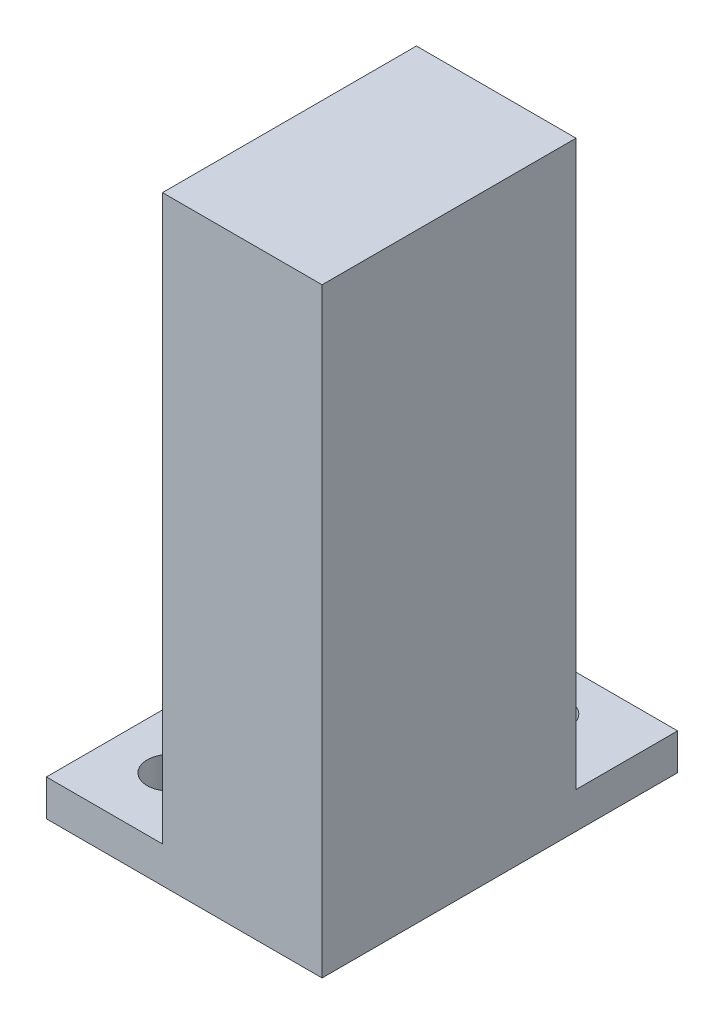
ISO-10303-21;
HEADER;
FILE_DESCRIPTION(('STEP AP214'),'2;1');
FILE_NAME('part.step','',(''),(''),'','','');
FILE_SCHEMA(('AUTOMOTIVE_DESIGN { 1 0 10303 214 1 1 1 1 }'));
ENDSEC;
DATA;
#1=APPLICATION_CONTEXT('core data for automotive mechanical design processes');
#2=APPLICATION_PROTOCOL_DEFINITION('international standard','automotive_design',2000,#1);
#3=PRODUCT_CONTEXT('',#1,'mechanical');
#4=PRODUCT('Part','Part','',(#3));
#5=PRODUCT_RELATED_PRODUCT_CATEGORY('part','',(#4));
#6=PRODUCT_DEFINITION_FORMATION('','',#4);
#7=PRODUCT_DEFINITION_CONTEXT('part definition',#1,'design');
#8=PRODUCT_DEFINITION('design','',#6,#7);
#9=PRODUCT_DEFINITION_SHAPE('','',#8);
#10=(LENGTH_UNIT() NAMED_UNIT(*) SI_UNIT(.MILLI.,.METRE.));
#11=(NAMED_UNIT(*) PLANE_ANGLE_UNIT() SI_UNIT($,.RADIAN.));
#12=(NAMED_UNIT(*) SI_UNIT($,.STERADIAN.) SOLID_ANGLE_UNIT());
#13=UNCERTAINTY_MEASURE_WITH_UNIT(LENGTH_MEASURE(1.E-05),#10,'distance_accuracy_value','');
#14=(GEOMETRIC_REPRESENTATION_CONTEXT(3) GLOBAL_UNCERTAINTY_ASSIGNED_CONTEXT((#13)) GLOBAL_UNIT_ASSIGNED_CONTEXT((#10,
#11,#12)) REPRESENTATION_CONTEXT('',''));
#15=CARTESIAN_POINT('',(0.,0.,0.));
#16=DIRECTION('',(0.,0.,1.));
#17=DIRECTION('',(1.,0.,0.));
#18=AXIS2_PLACEMENT_3D('',#15,#16,#17);
#19=CARTESIAN_POINT('',(0.,0.,0.));
#20=DIRECTION('',(0.,0.,1.));
#21=DIRECTION('',(1.,0.,0.));
#22=AXIS2_PLACEMENT_3D('',#19,#20,#21);
#23=PLANE('',#22);
#24=CARTESIAN_POINT('',(0.,35.7196543089587,0.));
#25=DIRECTION('',(0.,0.,1.));
#26=DIRECTION('',(1.,0.,0.));
#27=AXIS2_PLACEMENT_3D('',#24,#25,#26);
#28=CIRCLE('',#27,3.1);
#29=CARTESIAN_POINT('',(3.09999999999999,35.7196543089587,0.));
#30=VERTEX_POINT('',#29);
#31=EDGE_CURVE('E226',#30,#30,#28,.T.);
#32=ORIENTED_EDGE('',*,*,#31,.T.);
#33=EDGE_LOOP('',(#32));
#34=FACE_BOUND('',#33,.T.);
#35=CARTESIAN_POINT('',(0.,7.7196543089587,0.));
#36=DIRECTION('',(0.,0.,1.));
#37=DIRECTION('',(1.,0.,0.));
#38=AXIS2_PLACEMENT_3D('',#35,#36,#37);
#39=CIRCLE('',#38,3.1);
#40=CARTESIAN_POINT('',(3.1,7.7196543089587,0.));
#41=VERTEX_POINT('',#40);
#42=EDGE_CURVE('E222',#41,#41,#39,.T.);
#43=ORIENTED_EDGE('',*,*,#42,.T.);
#44=EDGE_LOOP('',(#43));
#45=FACE_BOUND('',#44,.T.);
#46=DIRECTION('',(1.,0.,0.));
#47=VECTOR('',#46,1.);
#48=CARTESIAN_POINT('',(0.,-28.5303456910413,0.));
#49=LINE('',#48,#47);
#50=CARTESIAN_POINT('',(-11.,-28.5303456910413,0.));
#51=VERTEX_POINT('',#50);
#52=CARTESIAN_POINT('',(11.,-28.5303456910413,0.));
#53=VERTEX_POINT('',#52);
#54=EDGE_CURVE('E132',#51,#53,#49,.T.);
#55=ORIENTED_EDGE('',*,*,#54,.F.);
#56=DIRECTION('',(0.,-1.,0.));
#57=VECTOR('',#56,1.);
#58=CARTESIAN_POINT('',(-11.,49.2196543089587,0.));
#59=LINE('',#58,#57);
#60=CARTESIAN_POINT('',(-11.,49.2196543089587,0.));
#61=VERTEX_POINT('',#60);
#62=EDGE_CURVE('E237',#61,#51,#59,.T.);
#63=ORIENTED_EDGE('',*,*,#62,.F.);
#64=DIRECTION('',(-1.,0.,0.));
#65=VECTOR('',#64,1.);
#66=CARTESIAN_POINT('',(11.,49.2196543089587,0.));
#67=LINE('',#66,#65);
#68=CARTESIAN_POINT('',(11.,49.2196543089587,0.));
#69=VERTEX_POINT('',#68);
#70=EDGE_CURVE('E233',#69,#61,#67,.T.);
#71=ORIENTED_EDGE('',*,*,#70,.F.);
#72=DIRECTION('',(0.,1.,0.));
#73=VECTOR('',#72,1.);
#74=CARTESIAN_POINT('',(11.,49.2196543089587,0.));
#75=LINE('',#74,#73);
#76=EDGE_CURVE('E242',#53,#69,#75,.T.);
#77=ORIENTED_EDGE('',*,*,#76,.F.);
#78=EDGE_LOOP('',(#55,#63,#71,#77));
#79=FACE_BOUND('',#78,.T.);
#80=ADVANCED_FACE('F45',(#34,#45,#79),#23,.F.);
#81=CARTESIAN_POINT('',(-11.,49.2196543089587,30.));
#82=DIRECTION('',(1.,0.,0.));
#83=DIRECTION('',(0.,0.,-1.));
#84=AXIS2_PLACEMENT_3D('',#81,#82,#83);
#85=PLANE('',#84);
#86=DIRECTION('',(0.,0.,-1.));
#87=VECTOR('',#86,1.);
#88=CARTESIAN_POINT('',(-11.,-28.5303456910413,0.));
#89=LINE('',#88,#87);
#90=CARTESIAN_POINT('',(-11.,-28.5303456910413,35.));
#91=VERTEX_POINT('',#90);
#92=EDGE_CURVE('E69',#91,#51,#89,.T.);
#93=ORIENTED_EDGE('',*,*,#92,.F.);
#94=DIRECTION('',(0.,-1.,0.));
#95=VECTOR('',#94,1.);
#96=CARTESIAN_POINT('',(-11.,49.2196543089587,35.));
#97=LINE('',#96,#95);
#98=CARTESIAN_POINT('',(-11.,49.2196543089587,35.));
#99=VERTEX_POINT('',#98);
#100=EDGE_CURVE('E199',#99,#91,#97,.T.);
#101=ORIENTED_EDGE('',*,*,#100,.F.);
#102=DIRECTION('',(0.,0.,-1.));
#103=VECTOR('',#102,1.);
#104=CARTESIAN_POINT('',(-11.,49.2196543089587,30.));
#105=LINE('',#104,#103);
#106=EDGE_CURVE('E11',#99,#61,#105,.T.);
#107=ORIENTED_EDGE('',*,*,#106,.T.);
#108=ORIENTED_EDGE('',*,*,#62,.T.);
#109=EDGE_LOOP('',(#93,#101,#107,#108));
#110=FACE_BOUND('',#109,.T.);
#111=ADVANCED_FACE('F274',(#110),#85,.F.);
#112=DIRECTION('',(-1.,0.,0.));
#113=VECTOR('',#112,1.);
#114=CARTESIAN_POINT('',(0.,-28.5303456910413,0.));
#115=LINE('',#114,#113);
#116=CARTESIAN_POINT('',(-27.,-28.5303456910413,0.));
#117=VERTEX_POINT('',#116);
#118=EDGE_CURVE('E183',#51,#117,#115,.T.);
#119=ORIENTED_EDGE('',*,*,#118,.F.);
#120=DIRECTION('',(0.,-1.,0.));
#121=VECTOR('',#120,1.);
#122=CARTESIAN_POINT('',(-11.,-28.5303456910413,0.));
#123=LINE('',#122,#121);
#124=CARTESIAN_POINT('',(-11.,-33.5303456910413,0.));
#125=VERTEX_POINT('',#124);
#126=EDGE_CURVE('E123',#51,#125,#123,.T.);
#127=ORIENTED_EDGE('',*,*,#126,.T.);
#128=DIRECTION('',(1.,0.,0.));
#129=VECTOR('',#128,1.);
#130=CARTESIAN_POINT('',(-11.,-33.5303456910413,0.));
#131=LINE('',#130,#129);
#132=CARTESIAN_POINT('',(-27.,-33.5303456910413,0.));
#133=VERTEX_POINT('',#132);
#134=EDGE_CURVE('E138',#133,#125,#131,.T.);
#135=ORIENTED_EDGE('',*,*,#134,.F.);
#136=DIRECTION('',(0.,-1.,0.));
#137=VECTOR('',#136,1.);
#138=CARTESIAN_POINT('',(-27.,-28.5303456910413,0.));
#139=LINE('',#138,#137);
#140=EDGE_CURVE('E195',#117,#133,#139,.T.);
#141=ORIENTED_EDGE('',*,*,#140,.F.);
#142=EDGE_LOOP('',(#119,#127,#135,#141));
#143=FACE_BOUND('',#142,.T.);
#144=ADVANCED_FACE('F264',(#143),#23,.F.);
#145=CARTESIAN_POINT('',(11.,49.2196543089587,30.));
#146=DIRECTION('',(0.,-1.,0.));
#147=DIRECTION('',(0.,0.,-1.));
#148=AXIS2_PLACEMENT_3D('',#145,#146,#147);
#149=PLANE('',#148);
#150=ORIENTED_EDGE('',*,*,#70,.T.);
#151=ORIENTED_EDGE('',*,*,#106,.F.);
#152=DIRECTION('',(-1.,0.,0.));
#153=VECTOR('',#152,1.);
#154=CARTESIAN_POINT('',(11.,49.2196543089587,35.));
#155=LINE('',#154,#153);
#156=CARTESIAN_POINT('',(11.,49.2196543089587,35.));
#157=VERTEX_POINT('',#156);
#158=EDGE_CURVE('E213',#157,#99,#155,.T.);
#159=ORIENTED_EDGE('',*,*,#158,.F.);
#160=DIRECTION('',(0.,0.,-1.));
#161=VECTOR('',#160,1.);
#162=CARTESIAN_POINT('',(11.,49.2196543089587,30.));
#163=LINE('',#162,#161);
#164=EDGE_CURVE('E245',#157,#69,#163,.T.);
#165=ORIENTED_EDGE('',*,*,#164,.T.);
#166=EDGE_LOOP('',(#150,#151,#159,#165));
#167=FACE_BOUND('',#166,.T.);
#168=ADVANCED_FACE('F47',(#167),#149,.F.);
#169=CARTESIAN_POINT('',(-11.,-33.5303456910413,30.));
#170=DIRECTION('',(0.,1.,0.));
#171=DIRECTION('',(0.,0.,1.));
#172=AXIS2_PLACEMENT_3D('',#169,#170,#171);
#173=PLANE('',#172);
#174=ORIENTED_EDGE('',*,*,#134,.T.);
#175=DIRECTION('',(0.,0.,-1.));
#176=VECTOR('',#175,1.);
#177=CARTESIAN_POINT('',(-11.,-33.5303456910413,0.));
#178=LINE('',#177,#176);
#179=CARTESIAN_POINT('',(-11.,-33.5303456910413,-14.));
#180=VERTEX_POINT('',#179);
#181=EDGE_CURVE('E61',#125,#180,#178,.T.);
#182=ORIENTED_EDGE('',*,*,#181,.T.);
#183=DIRECTION('',(1.,0.,0.));
#184=VECTOR('',#183,1.);
#185=CARTESIAN_POINT('',(0.,-33.5303456910413,-14.));
#186=LINE('',#185,#184);
#187=CARTESIAN_POINT('',(11.,-33.5303456910413,-14.));
#188=VERTEX_POINT('',#187);
#189=EDGE_CURVE('E127',#180,#188,#186,.T.);
#190=ORIENTED_EDGE('',*,*,#189,.T.);
#191=DIRECTION('',(0.,0.,-1.));
#192=VECTOR('',#191,1.);
#193=CARTESIAN_POINT('',(11.,-33.5303456910413,30.));
#194=LINE('',#193,#192);
#195=CARTESIAN_POINT('',(11.,-33.5303456910413,35.));
#196=VERTEX_POINT('',#195);
#197=EDGE_CURVE('E54',#196,#188,#194,.T.);
#198=ORIENTED_EDGE('',*,*,#197,.F.);
#199=DIRECTION('',(1.,0.,0.));
#200=VECTOR('',#199,1.);
#201=CARTESIAN_POINT('',(-11.,-33.5303456910413,35.));
#202=LINE('',#201,#200);
#203=CARTESIAN_POINT('',(-27.,-33.5303456910413,35.));
#204=VERTEX_POINT('',#203);
#205=EDGE_CURVE('E205',#204,#196,#202,.T.);
#206=ORIENTED_EDGE('',*,*,#205,.F.);
#207=DIRECTION('',(0.,0.,1.));
#208=VECTOR('',#207,1.);
#209=CARTESIAN_POINT('',(-27.,-33.5303456910413,0.));
#210=LINE('',#209,#208);
#211=EDGE_CURVE('E172',#133,#204,#210,.T.);
#212=ORIENTED_EDGE('',*,*,#211,.F.);
#213=EDGE_LOOP('',(#174,#182,#190,#198,#206,#212));
#214=FACE_BOUND('',#213,.T.);
#215=CARTESIAN_POINT('',(-19.,-33.5303456910413,26.));
#216=DIRECTION('',(0.,-1.,0.));
#217=DIRECTION('',(0.,0.,-1.));
#218=AXIS2_PLACEMENT_3D('',#215,#216,#217);
#219=CIRCLE('',#218,3.1);
#220=CARTESIAN_POINT('',(-19.,-33.5303456910413,22.9));
#221=VERTEX_POINT('',#220);
#222=EDGE_CURVE('E140',#221,#221,#219,.T.);
#223=ORIENTED_EDGE('',*,*,#222,.F.);
#224=EDGE_LOOP('',(#223));
#225=FACE_BOUND('',#224,.T.);
#226=CARTESIAN_POINT('',(-19.,-33.5303456910413,9.));
#227=DIRECTION('',(0.,-1.,0.));
#228=DIRECTION('',(0.,0.,-1.));
#229=AXIS2_PLACEMENT_3D('',#226,#227,#228);
#230=CIRCLE('',#229,3.1);
#231=CARTESIAN_POINT('',(-19.,-33.5303456910413,5.9));
#232=VERTEX_POINT('',#231);
#233=EDGE_CURVE('E144',#232,#232,#230,.T.);
#234=ORIENTED_EDGE('',*,*,#233,.F.);
#235=EDGE_LOOP('',(#234));
#236=FACE_BOUND('',#235,.T.);
#237=CARTESIAN_POINT('',(0.,-33.5303456910413,-7.));
#238=DIRECTION('',(0.,-1.,0.));
#239=DIRECTION('',(0.,0.,-1.));
#240=AXIS2_PLACEMENT_3D('',#237,#238,#239);
#241=CIRCLE('',#240,3.1);
#242=CARTESIAN_POINT('',(0.,-33.5303456910413,-10.1));
#243=VERTEX_POINT('',#242);
#244=EDGE_CURVE('E148',#243,#243,#241,.T.);
#245=ORIENTED_EDGE('',*,*,#244,.F.);
#246=EDGE_LOOP('',(#245));
#247=FACE_BOUND('',#246,.T.);
#248=ADVANCED_FACE('F135',(#214,#225,#236,#247),#173,.F.);
#249=CARTESIAN_POINT('',(11.,49.2196543089587,30.));
#250=DIRECTION('',(-1.,0.,0.));
#251=DIRECTION('',(0.,0.,1.));
#252=AXIS2_PLACEMENT_3D('',#249,#250,#251);
#253=PLANE('',#252);
#254=ORIENTED_EDGE('',*,*,#197,.T.);
#255=DIRECTION('',(0.,-1.,0.));
#256=VECTOR('',#255,1.);
#257=CARTESIAN_POINT('',(11.,-28.5303456910413,-14.));
#258=LINE('',#257,#256);
#259=CARTESIAN_POINT('',(11.,-28.5303456910413,-14.));
#260=VERTEX_POINT('',#259);
#261=EDGE_CURVE('E129',#260,#188,#258,.T.);
#262=ORIENTED_EDGE('',*,*,#261,.F.);
#263=DIRECTION('',(0.,0.,1.));
#264=VECTOR('',#263,1.);
#265=CARTESIAN_POINT('',(11.,-28.5303456910413,0.));
#266=LINE('',#265,#264);
#267=EDGE_CURVE('E152',#260,#53,#266,.T.);
#268=ORIENTED_EDGE('',*,*,#267,.T.);
#269=ORIENTED_EDGE('',*,*,#76,.T.);
#270=ORIENTED_EDGE('',*,*,#164,.F.);
#271=DIRECTION('',(0.,1.,0.));
#272=VECTOR('',#271,1.);
#273=CARTESIAN_POINT('',(11.,-33.5303456910413,35.));
#274=LINE('',#273,#272);
#275=EDGE_CURVE('E209',#196,#157,#274,.T.);
#276=ORIENTED_EDGE('',*,*,#275,.F.);
#277=EDGE_LOOP('',(#254,#262,#268,#269,#270,#276));
#278=FACE_BOUND('',#277,.T.);
#279=ADVANCED_FACE('F251',(#278),#253,.F.);
#280=CARTESIAN_POINT('',(0.,35.7196543089587,30.));
#281=DIRECTION('',(0.,0.,-1.));
#282=DIRECTION('',(-1.,0.,0.));
#283=AXIS2_PLACEMENT_3D('',#280,#281,#282);
#284=CYLINDRICAL_SURFACE('',#283,3.1);
#285=CARTESIAN_POINT('',(0.,35.7196543089587,30.));
#286=DIRECTION('',(0.,0.,1.));
#287=DIRECTION('',(1.,0.,0.));
#288=AXIS2_PLACEMENT_3D('',#285,#286,#287);
#289=CIRCLE('',#288,3.1);
#290=CARTESIAN_POINT('',(3.09999999999999,35.7196543089587,30.));
#291=VERTEX_POINT('',#290);
#292=EDGE_CURVE('E221',#291,#291,#289,.T.);
#293=ORIENTED_EDGE('',*,*,#292,.T.);
#294=EDGE_LOOP('',(#293));
#295=FACE_BOUND('',#294,.T.);
#296=ORIENTED_EDGE('',*,*,#31,.F.);
#297=EDGE_LOOP('',(#296));
#298=FACE_BOUND('',#297,.T.);
#299=ADVANCED_FACE('F310',(#295,#298),#284,.F.);
#300=CARTESIAN_POINT('',(0.,7.7196543089587,30.));
#301=DIRECTION('',(0.,0.,-1.));
#302=DIRECTION('',(-1.,0.,0.));
#303=AXIS2_PLACEMENT_3D('',#300,#301,#302);
#304=CYLINDRICAL_SURFACE('',#303,3.1);
#305=CARTESIAN_POINT('',(0.,7.7196543089587,30.));
#306=DIRECTION('',(0.,0.,1.));
#307=DIRECTION('',(1.,0.,0.));
#308=AXIS2_PLACEMENT_3D('',#305,#306,#307);
#309=CIRCLE('',#308,3.1);
#310=CARTESIAN_POINT('',(3.1,7.7196543089587,30.));
#311=VERTEX_POINT('',#310);
#312=EDGE_CURVE('E217',#311,#311,#309,.T.);
#313=ORIENTED_EDGE('',*,*,#312,.T.);
#314=EDGE_LOOP('',(#313));
#315=FACE_BOUND('',#314,.T.);
#316=ORIENTED_EDGE('',*,*,#42,.F.);
#317=EDGE_LOOP('',(#316));
#318=FACE_BOUND('',#317,.T.);
#319=ADVANCED_FACE('F314',(#315,#318),#304,.F.);
#320=CARTESIAN_POINT('',(0.,0.,30.));
#321=DIRECTION('',(0.,0.,1.));
#322=DIRECTION('',(1.,0.,0.));
#323=AXIS2_PLACEMENT_3D('',#320,#321,#322);
#324=PLANE('',#323);
#325=ORIENTED_EDGE('',*,*,#312,.F.);
#326=EDGE_LOOP('',(#325));
#327=FACE_BOUND('',#326,.T.);
#328=ADVANCED_FACE('F319',(#327),#324,.F.);
#329=ORIENTED_EDGE('',*,*,#292,.F.);
#330=EDGE_LOOP('',(#329));
#331=FACE_BOUND('',#330,.T.);
#332=ADVANCED_FACE('F324',(#331),#324,.F.);
#333=CARTESIAN_POINT('',(0.,0.,35.));
#334=DIRECTION('',(0.,0.,1.));
#335=DIRECTION('',(1.,0.,0.));
#336=AXIS2_PLACEMENT_3D('',#333,#334,#335);
#337=PLANE('',#336);
#338=ORIENTED_EDGE('',*,*,#100,.T.);
#339=DIRECTION('',(1.,0.,0.));
#340=VECTOR('',#339,1.);
#341=CARTESIAN_POINT('',(0.,-28.5303456910413,35.));
#342=LINE('',#341,#340);
#343=CARTESIAN_POINT('',(-27.,-28.5303456910413,35.));
#344=VERTEX_POINT('',#343);
#345=EDGE_CURVE('E176',#344,#91,#342,.T.);
#346=ORIENTED_EDGE('',*,*,#345,.F.);
#347=DIRECTION('',(0.,-1.,0.));
#348=VECTOR('',#347,1.);
#349=CARTESIAN_POINT('',(-27.,-28.5303456910413,35.));
#350=LINE('',#349,#348);
#351=EDGE_CURVE('E187',#344,#204,#350,.T.);
#352=ORIENTED_EDGE('',*,*,#351,.T.);
#353=ORIENTED_EDGE('',*,*,#205,.T.);
#354=ORIENTED_EDGE('',*,*,#275,.T.);
#355=ORIENTED_EDGE('',*,*,#158,.T.);
#356=EDGE_LOOP('',(#338,#346,#352,#353,#354,#355));
#357=FACE_BOUND('',#356,.T.);
#358=ADVANCED_FACE('F254',(#357),#337,.T.);
#359=CARTESIAN_POINT('',(-19.,-28.5303456910413,9.));
#360=DIRECTION('',(0.,-1.,0.));
#361=DIRECTION('',(0.,0.,-1.));
#362=AXIS2_PLACEMENT_3D('',#359,#360,#361);
#363=CYLINDRICAL_SURFACE('',#362,3.1);
#364=CARTESIAN_POINT('',(-19.,-28.5303456910413,9.));
#365=DIRECTION('',(0.,-1.,0.));
#366=DIRECTION('',(0.,0.,-1.));
#367=AXIS2_PLACEMENT_3D('',#364,#365,#366);
#368=CIRCLE('',#367,3.1);
#369=CARTESIAN_POINT('',(-19.,-28.5303456910413,5.9));
#370=VERTEX_POINT('',#369);
#371=EDGE_CURVE('E171',#370,#370,#368,.T.);
#372=ORIENTED_EDGE('',*,*,#371,.F.);
#373=EDGE_LOOP('',(#372));
#374=FACE_BOUND('',#373,.T.);
#375=ORIENTED_EDGE('',*,*,#233,.T.);
#376=EDGE_LOOP('',(#375));
#377=FACE_BOUND('',#376,.T.);
#378=ADVANCED_FACE('F330',(#374,#377),#363,.F.);
#379=CARTESIAN_POINT('',(-19.,-28.5303456910413,26.));
#380=DIRECTION('',(0.,-1.,0.));
#381=DIRECTION('',(0.,0.,-1.));
#382=AXIS2_PLACEMENT_3D('',#379,#380,#381);
#383=CYLINDRICAL_SURFACE('',#382,3.1);
#384=CARTESIAN_POINT('',(-19.,-28.5303456910413,26.));
#385=DIRECTION('',(0.,-1.,0.));
#386=DIRECTION('',(0.,0.,-1.));
#387=AXIS2_PLACEMENT_3D('',#384,#385,#386);
#388=CIRCLE('',#387,3.1);
#389=CARTESIAN_POINT('',(-19.,-28.5303456910413,22.9));
#390=VERTEX_POINT('',#389);
#391=EDGE_CURVE('E167',#390,#390,#388,.T.);
#392=ORIENTED_EDGE('',*,*,#391,.F.);
#393=EDGE_LOOP('',(#392));
#394=FACE_BOUND('',#393,.T.);
#395=ORIENTED_EDGE('',*,*,#222,.T.);
#396=EDGE_LOOP('',(#395));
#397=FACE_BOUND('',#396,.T.);
#398=ADVANCED_FACE('F285',(#394,#397),#383,.F.);
#399=CARTESIAN_POINT('',(-27.,-28.5303456910413,0.));
#400=DIRECTION('',(1.,0.,0.));
#401=DIRECTION('',(0.,0.,-1.));
#402=AXIS2_PLACEMENT_3D('',#399,#400,#401);
#403=PLANE('',#402);
#404=ORIENTED_EDGE('',*,*,#211,.T.);
#405=ORIENTED_EDGE('',*,*,#351,.F.);
#406=DIRECTION('',(0.,0.,1.));
#407=VECTOR('',#406,1.);
#408=CARTESIAN_POINT('',(-27.,-28.5303456910413,0.));
#409=LINE('',#408,#407);
#410=EDGE_CURVE('E180',#117,#344,#409,.T.);
#411=ORIENTED_EDGE('',*,*,#410,.F.);
#412=ORIENTED_EDGE('',*,*,#140,.T.);
#413=EDGE_LOOP('',(#404,#405,#411,#412));
#414=FACE_BOUND('',#413,.T.);
#415=ADVANCED_FACE('F260',(#414),#403,.F.);
#416=CARTESIAN_POINT('',(0.,-28.5303456910413,0.));
#417=DIRECTION('',(0.,-1.,0.));
#418=DIRECTION('',(0.,0.,-1.));
#419=AXIS2_PLACEMENT_3D('',#416,#417,#418);
#420=PLANE('',#419);
#421=ORIENTED_EDGE('',*,*,#391,.T.);
#422=EDGE_LOOP('',(#421));
#423=FACE_BOUND('',#422,.T.);
#424=ORIENTED_EDGE('',*,*,#371,.T.);
#425=EDGE_LOOP('',(#424));
#426=FACE_BOUND('',#425,.T.);
#427=ORIENTED_EDGE('',*,*,#345,.T.);
#428=ORIENTED_EDGE('',*,*,#92,.T.);
#429=ORIENTED_EDGE('',*,*,#118,.T.);
#430=ORIENTED_EDGE('',*,*,#410,.T.);
#431=EDGE_LOOP('',(#427,#428,#429,#430));
#432=FACE_BOUND('',#431,.T.);
#433=ADVANCED_FACE('F276',(#423,#426,#432),#420,.F.);
#434=CARTESIAN_POINT('',(0.,-28.5303456910413,-14.));
#435=DIRECTION('',(0.,0.,-1.));
#436=DIRECTION('',(-1.,0.,0.));
#437=AXIS2_PLACEMENT_3D('',#434,#435,#436);
#438=PLANE('',#437);
#439=ORIENTED_EDGE('',*,*,#189,.F.);
#440=DIRECTION('',(0.,-1.,0.));
#441=VECTOR('',#440,1.);
#442=CARTESIAN_POINT('',(-11.,-28.5303456910413,-14.));
#443=LINE('',#442,#441);
#444=CARTESIAN_POINT('',(-11.,-28.5303456910413,-14.));
#445=VERTEX_POINT('',#444);
#446=EDGE_CURVE('E114',#445,#180,#443,.T.);
#447=ORIENTED_EDGE('',*,*,#446,.F.);
#448=DIRECTION('',(1.,0.,0.));
#449=VECTOR('',#448,1.);
#450=CARTESIAN_POINT('',(0.,-28.5303456910413,-14.));
#451=LINE('',#450,#449);
#452=EDGE_CURVE('E161',#445,#260,#451,.T.);
#453=ORIENTED_EDGE('',*,*,#452,.T.);
#454=ORIENTED_EDGE('',*,*,#261,.T.);
#455=EDGE_LOOP('',(#439,#447,#453,#454));
#456=FACE_BOUND('',#455,.T.);
#457=ADVANCED_FACE('F128',(#456),#438,.T.);
#458=CARTESIAN_POINT('',(-11.,-28.5303456910413,0.));
#459=DIRECTION('',(-1.,0.,0.));
#460=DIRECTION('',(0.,0.,1.));
#461=AXIS2_PLACEMENT_3D('',#458,#459,#460);
#462=PLANE('',#461);
#463=ORIENTED_EDGE('',*,*,#181,.F.);
#464=ORIENTED_EDGE('',*,*,#126,.F.);
#465=DIRECTION('',(0.,0.,-1.));
#466=VECTOR('',#465,1.);
#467=CARTESIAN_POINT('',(-11.,-28.5303456910413,0.));
#468=LINE('',#467,#466);
#469=EDGE_CURVE('E118',#51,#445,#468,.T.);
#470=ORIENTED_EDGE('',*,*,#469,.T.);
#471=ORIENTED_EDGE('',*,*,#446,.T.);
#472=EDGE_LOOP('',(#463,#464,#470,#471));
#473=FACE_BOUND('',#472,.T.);
#474=ADVANCED_FACE('F116',(#473),#462,.T.);
#475=CARTESIAN_POINT('',(0.,-28.5303456910413,-7.));
#476=DIRECTION('',(0.,-1.,0.));
#477=DIRECTION('',(0.,0.,-1.));
#478=AXIS2_PLACEMENT_3D('',#475,#476,#477);
#479=CYLINDRICAL_SURFACE('',#478,3.1);
#480=CARTESIAN_POINT('',(0.,-28.5303456910413,-7.));
#481=DIRECTION('',(0.,-1.,0.));
#482=DIRECTION('',(0.,0.,-1.));
#483=AXIS2_PLACEMENT_3D('',#480,#481,#482);
#484=CIRCLE('',#483,3.1);
#485=CARTESIAN_POINT('',(0.,-28.5303456910413,-10.1));
#486=VERTEX_POINT('',#485);
#487=EDGE_CURVE('E157',#486,#486,#484,.T.);
#488=ORIENTED_EDGE('',*,*,#487,.F.);
#489=EDGE_LOOP('',(#488));
#490=FACE_BOUND('',#489,.T.);
#491=ORIENTED_EDGE('',*,*,#244,.T.);
#492=EDGE_LOOP('',(#491));
#493=FACE_BOUND('',#492,.T.);
#494=ADVANCED_FACE('F345',(#490,#493),#479,.F.);
#495=CARTESIAN_POINT('',(0.,-28.5303456910413,0.));
#496=DIRECTION('',(0.,-1.,0.));
#497=DIRECTION('',(0.,0.,-1.));
#498=AXIS2_PLACEMENT_3D('',#495,#496,#497);
#499=PLANE('',#498);
#500=ORIENTED_EDGE('',*,*,#487,.T.);
#501=EDGE_LOOP('',(#500));
#502=FACE_BOUND('',#501,.T.);
#503=ORIENTED_EDGE('',*,*,#452,.F.);
#504=ORIENTED_EDGE('',*,*,#469,.F.);
#505=ORIENTED_EDGE('',*,*,#54,.T.);
#506=ORIENTED_EDGE('',*,*,#267,.F.);
#507=EDGE_LOOP('',(#503,#504,#505,#506));
#508=FACE_BOUND('',#507,.T.);
#509=ADVANCED_FACE('F270',(#502,#508),#499,.F.);
#510=CLOSED_SHELL('',(#80,#111,#144,#168,#248,#279,#299,#319,#328,#332,#358,#378,#398,#415,#433,
#457,#474,#494,#509));
#511=MANIFOLD_SOLID_BREP('B2',#510);
#512=ADVANCED_BREP_SHAPE_REPRESENTATION('',(#18,#511),#14);
#513=SHAPE_DEFINITION_REPRESENTATION(#9,#512);
ENDSEC;
END-ISO-10303-21;
